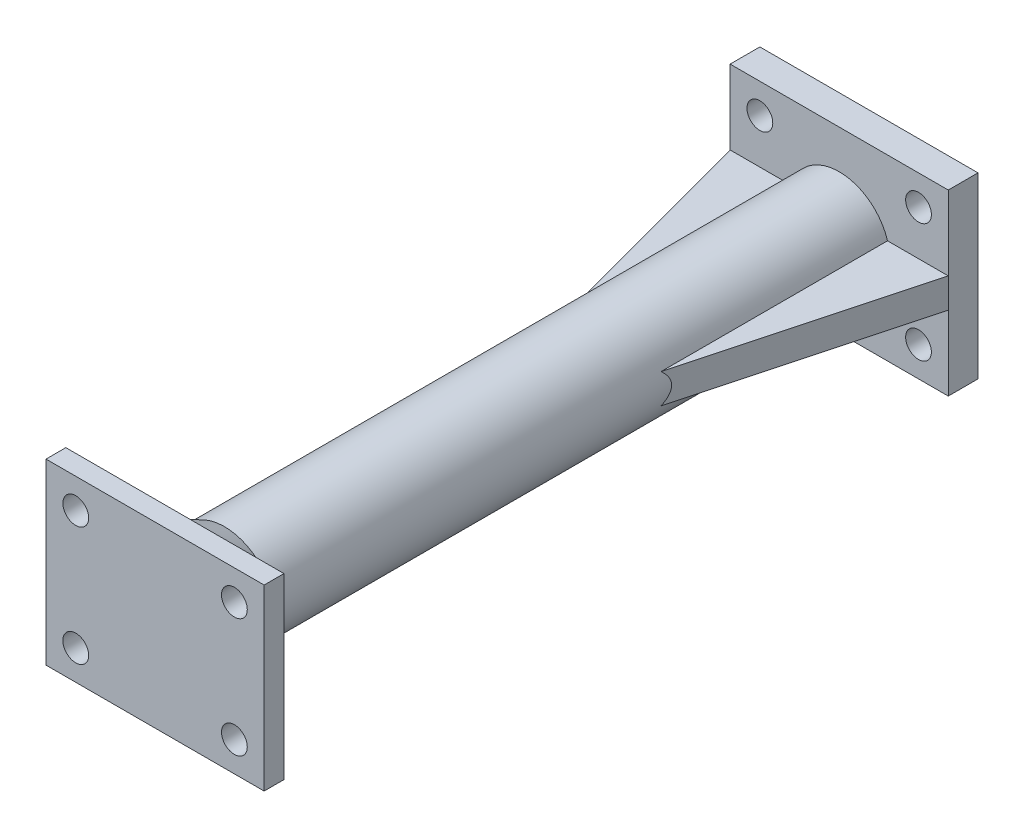
ISO-10303-21;
HEADER;
FILE_DESCRIPTION(('STEP AP214'),'2;1');
FILE_NAME('part.step','',(''),(''),'','','');
FILE_SCHEMA(('AUTOMOTIVE_DESIGN { 1 0 10303 214 1 1 1 1 }'));
ENDSEC;
DATA;
#1=APPLICATION_CONTEXT('core data for automotive mechanical design processes');
#2=APPLICATION_PROTOCOL_DEFINITION('international standard','automotive_design',2000,#1);
#3=PRODUCT_CONTEXT('',#1,'mechanical');
#4=PRODUCT('Part','Part','',(#3));
#5=PRODUCT_RELATED_PRODUCT_CATEGORY('part','',(#4));
#6=PRODUCT_DEFINITION_FORMATION('','',#4);
#7=PRODUCT_DEFINITION_CONTEXT('part definition',#1,'design');
#8=PRODUCT_DEFINITION('design','',#6,#7);
#9=PRODUCT_DEFINITION_SHAPE('','',#8);
#10=(LENGTH_UNIT() NAMED_UNIT(*) SI_UNIT(.MILLI.,.METRE.));
#11=(NAMED_UNIT(*) PLANE_ANGLE_UNIT() SI_UNIT($,.RADIAN.));
#12=(NAMED_UNIT(*) SI_UNIT($,.STERADIAN.) SOLID_ANGLE_UNIT());
#13=UNCERTAINTY_MEASURE_WITH_UNIT(LENGTH_MEASURE(1.E-05),#10,'distance_accuracy_value','');
#14=(GEOMETRIC_REPRESENTATION_CONTEXT(3) GLOBAL_UNCERTAINTY_ASSIGNED_CONTEXT((#13)) GLOBAL_UNIT_ASSIGNED_CONTEXT((#10,
#11,#12)) REPRESENTATION_CONTEXT('',''));
#15=CARTESIAN_POINT('',(0.,0.,0.));
#16=DIRECTION('',(0.,0.,1.));
#17=DIRECTION('',(1.,0.,0.));
#18=AXIS2_PLACEMENT_3D('',#15,#16,#17);
#19=CARTESIAN_POINT('',(0.,0.,3.));
#20=DIRECTION('',(0.,0.,1.));
#21=DIRECTION('',(1.,0.,0.));
#22=AXIS2_PLACEMENT_3D('',#19,#20,#21);
#23=PLANE('',#22);
#24=CARTESIAN_POINT('',(8.,-6.,3.));
#25=DIRECTION('',(0.,0.,1.));
#26=DIRECTION('',(1.,0.,0.));
#27=AXIS2_PLACEMENT_3D('',#24,#25,#26);
#28=CIRCLE('',#27,1.3);
#29=CARTESIAN_POINT('',(9.3,-6.,3.));
#30=VERTEX_POINT('',#29);
#31=EDGE_CURVE('E257',#30,#30,#28,.T.);
#32=ORIENTED_EDGE('',*,*,#31,.F.);
#33=EDGE_LOOP('',(#32));
#34=FACE_BOUND('',#33,.T.);
#35=CARTESIAN_POINT('',(-8.,-6.,3.));
#36=DIRECTION('',(0.,0.,1.));
#37=DIRECTION('',(1.,0.,0.));
#38=AXIS2_PLACEMENT_3D('',#35,#36,#37);
#39=CIRCLE('',#38,1.3);
#40=CARTESIAN_POINT('',(-6.7,-6.,3.));
#41=VERTEX_POINT('',#40);
#42=EDGE_CURVE('E260',#41,#41,#39,.T.);
#43=ORIENTED_EDGE('',*,*,#42,.F.);
#44=EDGE_LOOP('',(#43));
#45=FACE_BOUND('',#44,.T.);
#46=DIRECTION('',(0.,-1.,0.));
#47=VECTOR('',#46,1.);
#48=CARTESIAN_POINT('',(11.,0.,3.));
#49=LINE('',#48,#47);
#50=CARTESIAN_POINT('',(11.,-1.5,3.));
#51=VERTEX_POINT('',#50);
#52=CARTESIAN_POINT('',(11.,-9.,3.));
#53=VERTEX_POINT('',#52);
#54=EDGE_CURVE('E62',#51,#53,#49,.T.);
#55=ORIENTED_EDGE('',*,*,#54,.F.);
#56=DIRECTION('',(-1.,0.,0.));
#57=VECTOR('',#56,1.);
#58=CARTESIAN_POINT('',(0.,-1.5,3.));
#59=LINE('',#58,#57);
#60=CARTESIAN_POINT('',(4.87442304278157,-1.5,3.));
#61=VERTEX_POINT('',#60);
#62=EDGE_CURVE('E162',#51,#61,#59,.T.);
#63=ORIENTED_EDGE('',*,*,#62,.T.);
#64=CARTESIAN_POINT('',(0.,0.,3.));
#65=DIRECTION('',(0.,0.,1.));
#66=DIRECTION('',(1.,0.,0.));
#67=AXIS2_PLACEMENT_3D('',#64,#65,#66);
#68=CIRCLE('',#67,5.1);
#69=CARTESIAN_POINT('',(-4.87442304278158,-1.5,3.));
#70=VERTEX_POINT('',#69);
#71=EDGE_CURVE('E150',#70,#61,#68,.T.);
#72=ORIENTED_EDGE('',*,*,#71,.F.);
#73=DIRECTION('',(-1.,0.,0.));
#74=VECTOR('',#73,1.);
#75=CARTESIAN_POINT('',(0.,-1.5,3.));
#76=LINE('',#75,#74);
#77=CARTESIAN_POINT('',(-11.,-1.5,3.));
#78=VERTEX_POINT('',#77);
#79=EDGE_CURVE('E190',#70,#78,#76,.T.);
#80=ORIENTED_EDGE('',*,*,#79,.T.);
#81=DIRECTION('',(0.,-1.,0.));
#82=VECTOR('',#81,1.);
#83=CARTESIAN_POINT('',(-11.,0.,3.));
#84=LINE('',#83,#82);
#85=CARTESIAN_POINT('',(-11.,-9.,3.));
#86=VERTEX_POINT('',#85);
#87=EDGE_CURVE('E275',#78,#86,#84,.T.);
#88=ORIENTED_EDGE('',*,*,#87,.T.);
#89=DIRECTION('',(1.,0.,0.));
#90=VECTOR('',#89,1.);
#91=CARTESIAN_POINT('',(0.,-9.,3.));
#92=LINE('',#91,#90);
#93=EDGE_CURVE('E279',#86,#53,#92,.T.);
#94=ORIENTED_EDGE('',*,*,#93,.T.);
#95=EDGE_LOOP('',(#55,#63,#72,#80,#88,#94));
#96=FACE_BOUND('',#95,.T.);
#97=ADVANCED_FACE('F46',(#34,#45,#96),#23,.T.);
#98=CARTESIAN_POINT('',(11.,0.,3.));
#99=DIRECTION('',(1.,0.,0.));
#100=DIRECTION('',(0.,0.,-1.));
#101=AXIS2_PLACEMENT_3D('',#98,#99,#100);
#102=PLANE('',#101);
#103=CARTESIAN_POINT('',(11.,9.,3.));
#104=VERTEX_POINT('',#103);
#105=CARTESIAN_POINT('',(11.,1.5,3.));
#106=VERTEX_POINT('',#105);
#107=EDGE_CURVE('E270',#104,#106,#49,.T.);
#108=ORIENTED_EDGE('',*,*,#107,.T.);
#109=DIRECTION('',(0.,-1.,0.));
#110=VECTOR('',#109,1.);
#111=CARTESIAN_POINT('',(11.,0.,3.));
#112=LINE('',#111,#110);
#113=EDGE_CURVE('E180',#51,#106,#112,.F.);
#114=ORIENTED_EDGE('',*,*,#113,.F.);
#115=ORIENTED_EDGE('',*,*,#54,.T.);
#116=DIRECTION('',(0.,0.,-1.));
#117=VECTOR('',#116,1.);
#118=CARTESIAN_POINT('',(11.,-9.,3.));
#119=LINE('',#118,#117);
#120=CARTESIAN_POINT('',(11.,-9.,0.));
#121=VERTEX_POINT('',#120);
#122=EDGE_CURVE('E281',#53,#121,#119,.T.);
#123=ORIENTED_EDGE('',*,*,#122,.T.);
#124=DIRECTION('',(0.,-1.,0.));
#125=VECTOR('',#124,1.);
#126=CARTESIAN_POINT('',(11.,0.,0.));
#127=LINE('',#126,#125);
#128=CARTESIAN_POINT('',(11.,9.,0.));
#129=VERTEX_POINT('',#128);
#130=EDGE_CURVE('E293',#129,#121,#127,.T.);
#131=ORIENTED_EDGE('',*,*,#130,.F.);
#132=DIRECTION('',(0.,0.,-1.));
#133=VECTOR('',#132,1.);
#134=CARTESIAN_POINT('',(11.,9.,3.));
#135=LINE('',#134,#133);
#136=EDGE_CURVE('E309',#104,#129,#135,.T.);
#137=ORIENTED_EDGE('',*,*,#136,.F.);
#138=EDGE_LOOP('',(#108,#114,#115,#123,#131,#137));
#139=FACE_BOUND('',#138,.T.);
#140=ADVANCED_FACE('F337',(#139),#102,.T.);
#141=CARTESIAN_POINT('',(0.,9.,3.));
#142=DIRECTION('',(0.,1.,0.));
#143=DIRECTION('',(0.,0.,1.));
#144=AXIS2_PLACEMENT_3D('',#141,#142,#143);
#145=PLANE('',#144);
#146=DIRECTION('',(1.,0.,0.));
#147=VECTOR('',#146,1.);
#148=CARTESIAN_POINT('',(0.,9.,0.));
#149=LINE('',#148,#147);
#150=CARTESIAN_POINT('',(-11.,9.,0.));
#151=VERTEX_POINT('',#150);
#152=EDGE_CURVE('E295',#151,#129,#149,.T.);
#153=ORIENTED_EDGE('',*,*,#152,.F.);
#154=DIRECTION('',(0.,0.,-1.));
#155=VECTOR('',#154,1.);
#156=CARTESIAN_POINT('',(-11.,9.,3.));
#157=LINE('',#156,#155);
#158=CARTESIAN_POINT('',(-11.,9.,3.));
#159=VERTEX_POINT('',#158);
#160=EDGE_CURVE('E307',#159,#151,#157,.T.);
#161=ORIENTED_EDGE('',*,*,#160,.F.);
#162=DIRECTION('',(1.,0.,0.));
#163=VECTOR('',#162,1.);
#164=CARTESIAN_POINT('',(0.,9.,3.));
#165=LINE('',#164,#163);
#166=EDGE_CURVE('E272',#159,#104,#165,.T.);
#167=ORIENTED_EDGE('',*,*,#166,.T.);
#168=ORIENTED_EDGE('',*,*,#136,.T.);
#169=EDGE_LOOP('',(#153,#161,#167,#168));
#170=FACE_BOUND('',#169,.T.);
#171=ADVANCED_FACE('F342',(#170),#145,.T.);
#172=CARTESIAN_POINT('',(-11.,0.,3.));
#173=DIRECTION('',(1.,0.,0.));
#174=DIRECTION('',(0.,0.,-1.));
#175=AXIS2_PLACEMENT_3D('',#172,#173,#174);
#176=PLANE('',#175);
#177=DIRECTION('',(0.,-1.,0.));
#178=VECTOR('',#177,1.);
#179=CARTESIAN_POINT('',(-11.,0.,0.));
#180=LINE('',#179,#178);
#181=CARTESIAN_POINT('',(-11.,-9.,0.));
#182=VERTEX_POINT('',#181);
#183=EDGE_CURVE('E298',#151,#182,#180,.T.);
#184=ORIENTED_EDGE('',*,*,#183,.T.);
#185=DIRECTION('',(0.,0.,-1.));
#186=VECTOR('',#185,1.);
#187=CARTESIAN_POINT('',(-11.,-9.,3.));
#188=LINE('',#187,#186);
#189=EDGE_CURVE('E304',#86,#182,#188,.T.);
#190=ORIENTED_EDGE('',*,*,#189,.F.);
#191=ORIENTED_EDGE('',*,*,#87,.F.);
#192=DIRECTION('',(0.,-1.,0.));
#193=VECTOR('',#192,1.);
#194=CARTESIAN_POINT('',(-11.,0.,3.));
#195=LINE('',#194,#193);
#196=CARTESIAN_POINT('',(-11.,1.5,3.));
#197=VERTEX_POINT('',#196);
#198=EDGE_CURVE('E199',#197,#78,#195,.T.);
#199=ORIENTED_EDGE('',*,*,#198,.F.);
#200=EDGE_CURVE('E276',#159,#197,#84,.T.);
#201=ORIENTED_EDGE('',*,*,#200,.F.);
#202=ORIENTED_EDGE('',*,*,#160,.T.);
#203=EDGE_LOOP('',(#184,#190,#191,#199,#201,#202));
#204=FACE_BOUND('',#203,.T.);
#205=ADVANCED_FACE('F364',(#204),#176,.F.);
#206=CARTESIAN_POINT('',(-8.,6.,3.));
#207=DIRECTION('',(0.,0.,-1.));
#208=DIRECTION('',(-1.,0.,0.));
#209=AXIS2_PLACEMENT_3D('',#206,#207,#208);
#210=CYLINDRICAL_SURFACE('',#209,1.3);
#211=CARTESIAN_POINT('',(-8.,6.,3.));
#212=DIRECTION('',(0.,0.,1.));
#213=DIRECTION('',(1.,0.,0.));
#214=AXIS2_PLACEMENT_3D('',#211,#212,#213);
#215=CIRCLE('',#214,1.3);
#216=CARTESIAN_POINT('',(-6.7,6.,3.));
#217=VERTEX_POINT('',#216);
#218=EDGE_CURVE('E267',#217,#217,#215,.T.);
#219=ORIENTED_EDGE('',*,*,#218,.T.);
#220=EDGE_LOOP('',(#219));
#221=FACE_BOUND('',#220,.T.);
#222=CARTESIAN_POINT('',(-8.,6.,0.));
#223=DIRECTION('',(0.,0.,1.));
#224=DIRECTION('',(1.,0.,0.));
#225=AXIS2_PLACEMENT_3D('',#222,#223,#224);
#226=CIRCLE('',#225,1.3);
#227=CARTESIAN_POINT('',(-6.7,6.,0.));
#228=VERTEX_POINT('',#227);
#229=EDGE_CURVE('E290',#228,#228,#226,.T.);
#230=ORIENTED_EDGE('',*,*,#229,.F.);
#231=EDGE_LOOP('',(#230));
#232=FACE_BOUND('',#231,.T.);
#233=ADVANCED_FACE('F360',(#221,#232),#210,.F.);
#234=CARTESIAN_POINT('',(8.,6.,3.));
#235=DIRECTION('',(0.,0.,-1.));
#236=DIRECTION('',(-1.,0.,0.));
#237=AXIS2_PLACEMENT_3D('',#234,#235,#236);
#238=CYLINDRICAL_SURFACE('',#237,1.3);
#239=CARTESIAN_POINT('',(8.,6.,3.));
#240=DIRECTION('',(0.,0.,1.));
#241=DIRECTION('',(1.,0.,0.));
#242=AXIS2_PLACEMENT_3D('',#239,#240,#241);
#243=CIRCLE('',#242,1.3);
#244=CARTESIAN_POINT('',(9.3,6.,3.));
#245=VERTEX_POINT('',#244);
#246=EDGE_CURVE('E264',#245,#245,#243,.T.);
#247=ORIENTED_EDGE('',*,*,#246,.T.);
#248=EDGE_LOOP('',(#247));
#249=FACE_BOUND('',#248,.T.);
#250=CARTESIAN_POINT('',(8.,6.,0.));
#251=DIRECTION('',(0.,0.,1.));
#252=DIRECTION('',(1.,0.,0.));
#253=AXIS2_PLACEMENT_3D('',#250,#251,#252);
#254=CIRCLE('',#253,1.3);
#255=CARTESIAN_POINT('',(9.3,6.,0.));
#256=VERTEX_POINT('',#255);
#257=EDGE_CURVE('E287',#256,#256,#254,.T.);
#258=ORIENTED_EDGE('',*,*,#257,.F.);
#259=EDGE_LOOP('',(#258));
#260=FACE_BOUND('',#259,.T.);
#261=ADVANCED_FACE('F363',(#249,#260),#238,.F.);
#262=CARTESIAN_POINT('',(-8.,-6.,3.));
#263=DIRECTION('',(0.,0.,-1.));
#264=DIRECTION('',(-1.,0.,0.));
#265=AXIS2_PLACEMENT_3D('',#262,#263,#264);
#266=CYLINDRICAL_SURFACE('',#265,1.3);
#267=ORIENTED_EDGE('',*,*,#42,.T.);
#268=EDGE_LOOP('',(#267));
#269=FACE_BOUND('',#268,.T.);
#270=CARTESIAN_POINT('',(-8.,-6.,0.));
#271=DIRECTION('',(0.,0.,1.));
#272=DIRECTION('',(1.,0.,0.));
#273=AXIS2_PLACEMENT_3D('',#270,#271,#272);
#274=CIRCLE('',#273,1.3);
#275=CARTESIAN_POINT('',(-6.7,-6.,0.));
#276=VERTEX_POINT('',#275);
#277=EDGE_CURVE('E284',#276,#276,#274,.T.);
#278=ORIENTED_EDGE('',*,*,#277,.F.);
#279=EDGE_LOOP('',(#278));
#280=FACE_BOUND('',#279,.T.);
#281=ADVANCED_FACE('F376',(#269,#280),#266,.F.);
#282=CARTESIAN_POINT('',(8.,-6.,3.));
#283=DIRECTION('',(0.,0.,-1.));
#284=DIRECTION('',(-1.,0.,0.));
#285=AXIS2_PLACEMENT_3D('',#282,#283,#284);
#286=CYLINDRICAL_SURFACE('',#285,1.3);
#287=ORIENTED_EDGE('',*,*,#31,.T.);
#288=EDGE_LOOP('',(#287));
#289=FACE_BOUND('',#288,.T.);
#290=CARTESIAN_POINT('',(8.,-6.,0.));
#291=DIRECTION('',(0.,0.,1.));
#292=DIRECTION('',(1.,0.,0.));
#293=AXIS2_PLACEMENT_3D('',#290,#291,#292);
#294=CIRCLE('',#293,1.3);
#295=CARTESIAN_POINT('',(9.3,-6.,0.));
#296=VERTEX_POINT('',#295);
#297=EDGE_CURVE('E256',#296,#296,#294,.T.);
#298=ORIENTED_EDGE('',*,*,#297,.F.);
#299=EDGE_LOOP('',(#298));
#300=FACE_BOUND('',#299,.T.);
#301=ADVANCED_FACE('F352',(#289,#300),#286,.F.);
#302=CARTESIAN_POINT('',(0.,-9.,3.));
#303=DIRECTION('',(0.,1.,0.));
#304=DIRECTION('',(0.,0.,1.));
#305=AXIS2_PLACEMENT_3D('',#302,#303,#304);
#306=PLANE('',#305);
#307=DIRECTION('',(1.,0.,0.));
#308=VECTOR('',#307,1.);
#309=CARTESIAN_POINT('',(0.,-9.,0.));
#310=LINE('',#309,#308);
#311=EDGE_CURVE('E261',#182,#121,#310,.T.);
#312=ORIENTED_EDGE('',*,*,#311,.T.);
#313=ORIENTED_EDGE('',*,*,#122,.F.);
#314=ORIENTED_EDGE('',*,*,#93,.F.);
#315=ORIENTED_EDGE('',*,*,#189,.T.);
#316=EDGE_LOOP('',(#312,#313,#314,#315));
#317=FACE_BOUND('',#316,.T.);
#318=ADVANCED_FACE('F348',(#317),#306,.F.);
#319=DIRECTION('',(-1.,0.,0.));
#320=VECTOR('',#319,1.);
#321=CARTESIAN_POINT('',(0.,1.5,3.));
#322=LINE('',#321,#320);
#323=CARTESIAN_POINT('',(4.87442304278158,1.5,3.));
#324=VERTEX_POINT('',#323);
#325=EDGE_CURVE('E70',#106,#324,#322,.T.);
#326=ORIENTED_EDGE('',*,*,#325,.F.);
#327=ORIENTED_EDGE('',*,*,#107,.F.);
#328=ORIENTED_EDGE('',*,*,#166,.F.);
#329=ORIENTED_EDGE('',*,*,#200,.T.);
#330=DIRECTION('',(-1.,0.,0.));
#331=VECTOR('',#330,1.);
#332=CARTESIAN_POINT('',(0.,1.5,3.));
#333=LINE('',#332,#331);
#334=CARTESIAN_POINT('',(-4.87442304278158,1.5,3.));
#335=VERTEX_POINT('',#334);
#336=EDGE_CURVE('E194',#335,#197,#333,.T.);
#337=ORIENTED_EDGE('',*,*,#336,.F.);
#338=EDGE_CURVE('E159',#324,#335,#68,.T.);
#339=ORIENTED_EDGE('',*,*,#338,.F.);
#340=EDGE_LOOP('',(#326,#327,#328,#329,#337,#339));
#341=FACE_BOUND('',#340,.T.);
#342=ORIENTED_EDGE('',*,*,#246,.F.);
#343=EDGE_LOOP('',(#342));
#344=FACE_BOUND('',#343,.T.);
#345=ORIENTED_EDGE('',*,*,#218,.F.);
#346=EDGE_LOOP('',(#345));
#347=FACE_BOUND('',#346,.T.);
#348=ADVANCED_FACE('F331',(#341,#344,#347),#23,.T.);
#349=CARTESIAN_POINT('',(0.,0.,0.));
#350=DIRECTION('',(0.,0.,1.));
#351=DIRECTION('',(1.,0.,0.));
#352=AXIS2_PLACEMENT_3D('',#349,#350,#351);
#353=PLANE('',#352);
#354=ORIENTED_EDGE('',*,*,#257,.T.);
#355=EDGE_LOOP('',(#354));
#356=FACE_BOUND('',#355,.T.);
#357=ORIENTED_EDGE('',*,*,#229,.T.);
#358=EDGE_LOOP('',(#357));
#359=FACE_BOUND('',#358,.T.);
#360=ORIENTED_EDGE('',*,*,#130,.T.);
#361=ORIENTED_EDGE('',*,*,#311,.F.);
#362=ORIENTED_EDGE('',*,*,#183,.F.);
#363=ORIENTED_EDGE('',*,*,#152,.T.);
#364=EDGE_LOOP('',(#360,#361,#362,#363));
#365=FACE_BOUND('',#364,.T.);
#366=ORIENTED_EDGE('',*,*,#297,.T.);
#367=EDGE_LOOP('',(#366));
#368=FACE_BOUND('',#367,.T.);
#369=ORIENTED_EDGE('',*,*,#277,.T.);
#370=EDGE_LOOP('',(#369));
#371=FACE_BOUND('',#370,.T.);
#372=ADVANCED_FACE('F322',(#356,#359,#365,#368,#371),#353,.F.);
#373=CARTESIAN_POINT('',(0.,0.,70.));
#374=DIRECTION('',(0.,0.,-1.));
#375=DIRECTION('',(-1.,0.,0.));
#376=AXIS2_PLACEMENT_3D('',#373,#374,#375);
#377=CYLINDRICAL_SURFACE('',#376,5.1);
#378=DIRECTION('',(0.,0.,-1.));
#379=VECTOR('',#378,1.);
#380=CARTESIAN_POINT('',(4.87442304278157,1.5,70.));
#381=LINE('',#380,#379);
#382=CARTESIAN_POINT('',(4.87442304278158,1.5,25.8411344167467));
#383=VERTEX_POINT('',#382);
#384=EDGE_CURVE('E166',#383,#324,#381,.T.);
#385=ORIENTED_EDGE('',*,*,#384,.T.);
#386=ORIENTED_EDGE('',*,*,#338,.T.);
#387=DIRECTION('',(0.,0.,-1.));
#388=VECTOR('',#387,1.);
#389=CARTESIAN_POINT('',(-4.87442304278157,1.5,70.));
#390=LINE('',#389,#388);
#391=CARTESIAN_POINT('',(-4.87442304278158,1.5,25.8411344167467));
#392=VERTEX_POINT('',#391);
#393=EDGE_CURVE('E192',#335,#392,#390,.F.);
#394=ORIENTED_EDGE('',*,*,#393,.T.);
#395=CARTESIAN_POINT('',(0.,0.,44.0169491525424));
#396=DIRECTION('',(-0.965869632003452,0.,0.259028674037289));
#397=DIRECTION('',(-0.259028674037289,0.,-0.965869632003452));
#398=AXIS2_PLACEMENT_3D('',#395,#396,#397);
#399=ELLIPSE('',#398,19.6889399173846,5.1);
#400=CARTESIAN_POINT('',(-4.87442304278158,-1.5,25.8411344167466));
#401=VERTEX_POINT('',#400);
#402=EDGE_CURVE('E197',#392,#401,#399,.T.);
#403=ORIENTED_EDGE('',*,*,#402,.T.);
#404=DIRECTION('',(0.,0.,-1.));
#405=VECTOR('',#404,1.);
#406=CARTESIAN_POINT('',(-4.87442304278157,-1.5,70.));
#407=LINE('',#406,#405);
#408=EDGE_CURVE('E157',#70,#401,#407,.F.);
#409=ORIENTED_EDGE('',*,*,#408,.F.);
#410=ORIENTED_EDGE('',*,*,#71,.T.);
#411=DIRECTION('',(0.,0.,-1.));
#412=VECTOR('',#411,1.);
#413=CARTESIAN_POINT('',(4.87442304278157,-1.5,70.));
#414=LINE('',#413,#412);
#415=CARTESIAN_POINT('',(4.87442304278158,-1.5,25.8411344167466));
#416=VERTEX_POINT('',#415);
#417=EDGE_CURVE('E154',#416,#61,#414,.T.);
#418=ORIENTED_EDGE('',*,*,#417,.F.);
#419=CARTESIAN_POINT('',(0.,0.,44.0169491525424));
#420=DIRECTION('',(-0.965869632003452,0.,-0.259028674037289));
#421=DIRECTION('',(0.259028674037289,0.,-0.965869632003452));
#422=AXIS2_PLACEMENT_3D('',#419,#420,#421);
#423=ELLIPSE('',#422,19.6889399173846,5.1);
#424=EDGE_CURVE('E178',#416,#383,#423,.F.);
#425=ORIENTED_EDGE('',*,*,#424,.T.);
#426=EDGE_LOOP('',(#385,#386,#394,#403,#409,#410,#418,#425));
#427=FACE_BOUND('',#426,.T.);
#428=CARTESIAN_POINT('',(0.,0.,65.));
#429=DIRECTION('',(0.,0.,1.));
#430=DIRECTION('',(1.,0.,0.));
#431=AXIS2_PLACEMENT_3D('',#428,#429,#430);
#432=CIRCLE('',#431,5.1);
#433=CARTESIAN_POINT('',(5.1,0.,65.));
#434=VERTEX_POINT('',#433);
#435=EDGE_CURVE('E11',#434,#434,#432,.F.);
#436=ORIENTED_EDGE('',*,*,#435,.T.);
#437=EDGE_LOOP('',(#436));
#438=FACE_BOUND('',#437,.T.);
#439=ADVANCED_FACE('F151',(#427,#438),#377,.T.);
#440=CARTESIAN_POINT('',(11.,0.,72.));
#441=DIRECTION('',(1.,0.,0.));
#442=DIRECTION('',(0.,0.,-1.));
#443=AXIS2_PLACEMENT_3D('',#440,#441,#442);
#444=PLANE('',#443);
#445=DIRECTION('',(0.,-1.,0.));
#446=VECTOR('',#445,1.);
#447=CARTESIAN_POINT('',(11.,0.,72.));
#448=LINE('',#447,#446);
#449=CARTESIAN_POINT('',(11.,9.,72.));
#450=VERTEX_POINT('',#449);
#451=CARTESIAN_POINT('',(11.,-9.,72.));
#452=VERTEX_POINT('',#451);
#453=EDGE_CURVE('E216',#450,#452,#448,.T.);
#454=ORIENTED_EDGE('',*,*,#453,.T.);
#455=DIRECTION('',(0.,0.,-1.));
#456=VECTOR('',#455,1.);
#457=CARTESIAN_POINT('',(11.,-9.,72.));
#458=LINE('',#457,#456);
#459=CARTESIAN_POINT('',(11.,-9.,70.));
#460=VERTEX_POINT('',#459);
#461=EDGE_CURVE('E226',#452,#460,#458,.T.);
#462=ORIENTED_EDGE('',*,*,#461,.T.);
#463=DIRECTION('',(0.,-1.,0.));
#464=VECTOR('',#463,1.);
#465=CARTESIAN_POINT('',(11.,0.,70.));
#466=LINE('',#465,#464);
#467=CARTESIAN_POINT('',(11.,9.,70.));
#468=VERTEX_POINT('',#467);
#469=EDGE_CURVE('E238',#468,#460,#466,.T.);
#470=ORIENTED_EDGE('',*,*,#469,.F.);
#471=DIRECTION('',(0.,0.,-1.));
#472=VECTOR('',#471,1.);
#473=CARTESIAN_POINT('',(11.,9.,72.));
#474=LINE('',#473,#472);
#475=EDGE_CURVE('E254',#450,#468,#474,.T.);
#476=ORIENTED_EDGE('',*,*,#475,.F.);
#477=EDGE_LOOP('',(#454,#462,#470,#476));
#478=FACE_BOUND('',#477,.T.);
#479=ADVANCED_FACE('F321',(#478),#444,.T.);
#480=CARTESIAN_POINT('',(0.,9.,72.));
#481=DIRECTION('',(0.,1.,0.));
#482=DIRECTION('',(0.,0.,1.));
#483=AXIS2_PLACEMENT_3D('',#480,#481,#482);
#484=PLANE('',#483);
#485=DIRECTION('',(1.,0.,0.));
#486=VECTOR('',#485,1.);
#487=CARTESIAN_POINT('',(0.,9.,70.));
#488=LINE('',#487,#486);
#489=CARTESIAN_POINT('',(-11.,9.,70.));
#490=VERTEX_POINT('',#489);
#491=EDGE_CURVE('E240',#490,#468,#488,.T.);
#492=ORIENTED_EDGE('',*,*,#491,.F.);
#493=DIRECTION('',(0.,0.,-1.));
#494=VECTOR('',#493,1.);
#495=CARTESIAN_POINT('',(-11.,9.,72.));
#496=LINE('',#495,#494);
#497=CARTESIAN_POINT('',(-11.,9.,72.));
#498=VERTEX_POINT('',#497);
#499=EDGE_CURVE('E252',#498,#490,#496,.T.);
#500=ORIENTED_EDGE('',*,*,#499,.F.);
#501=DIRECTION('',(1.,0.,0.));
#502=VECTOR('',#501,1.);
#503=CARTESIAN_POINT('',(0.,9.,72.));
#504=LINE('',#503,#502);
#505=EDGE_CURVE('E218',#498,#450,#504,.T.);
#506=ORIENTED_EDGE('',*,*,#505,.T.);
#507=ORIENTED_EDGE('',*,*,#475,.T.);
#508=EDGE_LOOP('',(#492,#500,#506,#507));
#509=FACE_BOUND('',#508,.T.);
#510=ADVANCED_FACE('F328',(#509),#484,.T.);
#511=CARTESIAN_POINT('',(-11.,0.,72.));
#512=DIRECTION('',(1.,0.,0.));
#513=DIRECTION('',(0.,0.,-1.));
#514=AXIS2_PLACEMENT_3D('',#511,#512,#513);
#515=PLANE('',#514);
#516=DIRECTION('',(0.,-1.,0.));
#517=VECTOR('',#516,1.);
#518=CARTESIAN_POINT('',(-11.,0.,70.));
#519=LINE('',#518,#517);
#520=CARTESIAN_POINT('',(-11.,-9.,70.));
#521=VERTEX_POINT('',#520);
#522=EDGE_CURVE('E243',#490,#521,#519,.T.);
#523=ORIENTED_EDGE('',*,*,#522,.T.);
#524=DIRECTION('',(0.,0.,-1.));
#525=VECTOR('',#524,1.);
#526=CARTESIAN_POINT('',(-11.,-9.,72.));
#527=LINE('',#526,#525);
#528=CARTESIAN_POINT('',(-11.,-9.,72.));
#529=VERTEX_POINT('',#528);
#530=EDGE_CURVE('E249',#529,#521,#527,.T.);
#531=ORIENTED_EDGE('',*,*,#530,.F.);
#532=DIRECTION('',(0.,-1.,0.));
#533=VECTOR('',#532,1.);
#534=CARTESIAN_POINT('',(-11.,0.,72.));
#535=LINE('',#534,#533);
#536=EDGE_CURVE('E221',#498,#529,#535,.T.);
#537=ORIENTED_EDGE('',*,*,#536,.F.);
#538=ORIENTED_EDGE('',*,*,#499,.T.);
#539=EDGE_LOOP('',(#523,#531,#537,#538));
#540=FACE_BOUND('',#539,.T.);
#541=ADVANCED_FACE('F436',(#540),#515,.F.);
#542=CARTESIAN_POINT('',(-8.,6.,72.));
#543=DIRECTION('',(0.,0.,-1.));
#544=DIRECTION('',(-1.,0.,0.));
#545=AXIS2_PLACEMENT_3D('',#542,#543,#544);
#546=CYLINDRICAL_SURFACE('',#545,1.3);
#547=CARTESIAN_POINT('',(-8.,6.,72.));
#548=DIRECTION('',(0.,0.,1.));
#549=DIRECTION('',(1.,0.,0.));
#550=AXIS2_PLACEMENT_3D('',#547,#548,#549);
#551=CIRCLE('',#550,1.3);
#552=CARTESIAN_POINT('',(-6.7,6.,72.));
#553=VERTEX_POINT('',#552);
#554=EDGE_CURVE('E213',#553,#553,#551,.T.);
#555=ORIENTED_EDGE('',*,*,#554,.T.);
#556=EDGE_LOOP('',(#555));
#557=FACE_BOUND('',#556,.T.);
#558=CARTESIAN_POINT('',(-8.,6.,70.));
#559=DIRECTION('',(0.,0.,1.));
#560=DIRECTION('',(1.,0.,0.));
#561=AXIS2_PLACEMENT_3D('',#558,#559,#560);
#562=CIRCLE('',#561,1.3);
#563=CARTESIAN_POINT('',(-6.7,6.,70.));
#564=VERTEX_POINT('',#563);
#565=EDGE_CURVE('E235',#564,#564,#562,.T.);
#566=ORIENTED_EDGE('',*,*,#565,.F.);
#567=EDGE_LOOP('',(#566));
#568=FACE_BOUND('',#567,.T.);
#569=ADVANCED_FACE('F439',(#557,#568),#546,.F.);
#570=CARTESIAN_POINT('',(8.,-6.,72.));
#571=DIRECTION('',(0.,0.,-1.));
#572=DIRECTION('',(-1.,0.,0.));
#573=AXIS2_PLACEMENT_3D('',#570,#571,#572);
#574=CYLINDRICAL_SURFACE('',#573,1.3);
#575=CARTESIAN_POINT('',(8.,-6.,72.));
#576=DIRECTION('',(0.,0.,1.));
#577=DIRECTION('',(1.,0.,0.));
#578=AXIS2_PLACEMENT_3D('',#575,#576,#577);
#579=CIRCLE('',#578,1.3);
#580=CARTESIAN_POINT('',(9.3,-6.,72.));
#581=VERTEX_POINT('',#580);
#582=EDGE_CURVE('E210',#581,#581,#579,.T.);
#583=ORIENTED_EDGE('',*,*,#582,.T.);
#584=EDGE_LOOP('',(#583));
#585=FACE_BOUND('',#584,.T.);
#586=CARTESIAN_POINT('',(8.,-6.,70.));
#587=DIRECTION('',(0.,0.,1.));
#588=DIRECTION('',(1.,0.,0.));
#589=AXIS2_PLACEMENT_3D('',#586,#587,#588);
#590=CIRCLE('',#589,1.3);
#591=CARTESIAN_POINT('',(9.3,-6.,70.));
#592=VERTEX_POINT('',#591);
#593=EDGE_CURVE('E232',#592,#592,#590,.T.);
#594=ORIENTED_EDGE('',*,*,#593,.F.);
#595=EDGE_LOOP('',(#594));
#596=FACE_BOUND('',#595,.T.);
#597=ADVANCED_FACE('F446',(#585,#596),#574,.F.);
#598=CARTESIAN_POINT('',(8.,6.,72.));
#599=DIRECTION('',(0.,0.,-1.));
#600=DIRECTION('',(-1.,0.,0.));
#601=AXIS2_PLACEMENT_3D('',#598,#599,#600);
#602=CYLINDRICAL_SURFACE('',#601,1.3);
#603=CARTESIAN_POINT('',(8.,6.,72.));
#604=DIRECTION('',(0.,0.,1.));
#605=DIRECTION('',(1.,0.,0.));
#606=AXIS2_PLACEMENT_3D('',#603,#604,#605);
#607=CIRCLE('',#606,1.3);
#608=CARTESIAN_POINT('',(9.3,6.,72.));
#609=VERTEX_POINT('',#608);
#610=EDGE_CURVE('E206',#609,#609,#607,.T.);
#611=ORIENTED_EDGE('',*,*,#610,.T.);
#612=EDGE_LOOP('',(#611));
#613=FACE_BOUND('',#612,.T.);
#614=CARTESIAN_POINT('',(8.,6.,70.));
#615=DIRECTION('',(0.,0.,1.));
#616=DIRECTION('',(1.,0.,0.));
#617=AXIS2_PLACEMENT_3D('',#614,#615,#616);
#618=CIRCLE('',#617,1.3);
#619=CARTESIAN_POINT('',(9.3,6.,70.));
#620=VERTEX_POINT('',#619);
#621=EDGE_CURVE('E229',#620,#620,#618,.T.);
#622=ORIENTED_EDGE('',*,*,#621,.F.);
#623=EDGE_LOOP('',(#622));
#624=FACE_BOUND('',#623,.T.);
#625=ADVANCED_FACE('F450',(#613,#624),#602,.F.);
#626=CARTESIAN_POINT('',(-8.,-6.,72.));
#627=DIRECTION('',(0.,0.,-1.));
#628=DIRECTION('',(-1.,0.,0.));
#629=AXIS2_PLACEMENT_3D('',#626,#627,#628);
#630=CYLINDRICAL_SURFACE('',#629,1.3);
#631=CARTESIAN_POINT('',(-8.,-6.,72.));
#632=DIRECTION('',(0.,0.,1.));
#633=DIRECTION('',(1.,0.,0.));
#634=AXIS2_PLACEMENT_3D('',#631,#632,#633);
#635=CIRCLE('',#634,1.3);
#636=CARTESIAN_POINT('',(-6.7,-6.,72.));
#637=VERTEX_POINT('',#636);
#638=EDGE_CURVE('E203',#637,#637,#635,.T.);
#639=ORIENTED_EDGE('',*,*,#638,.T.);
#640=EDGE_LOOP('',(#639));
#641=FACE_BOUND('',#640,.T.);
#642=CARTESIAN_POINT('',(-8.,-6.,70.));
#643=DIRECTION('',(0.,0.,1.));
#644=DIRECTION('',(1.,0.,0.));
#645=AXIS2_PLACEMENT_3D('',#642,#643,#644);
#646=CIRCLE('',#645,1.3);
#647=CARTESIAN_POINT('',(-6.7,-6.,70.));
#648=VERTEX_POINT('',#647);
#649=EDGE_CURVE('E202',#648,#648,#646,.T.);
#650=ORIENTED_EDGE('',*,*,#649,.F.);
#651=EDGE_LOOP('',(#650));
#652=FACE_BOUND('',#651,.T.);
#653=ADVANCED_FACE('F434',(#641,#652),#630,.F.);
#654=CARTESIAN_POINT('',(0.,-9.,72.));
#655=DIRECTION('',(0.,1.,0.));
#656=DIRECTION('',(0.,0.,1.));
#657=AXIS2_PLACEMENT_3D('',#654,#655,#656);
#658=PLANE('',#657);
#659=DIRECTION('',(1.,0.,0.));
#660=VECTOR('',#659,1.);
#661=CARTESIAN_POINT('',(0.,-9.,70.));
#662=LINE('',#661,#660);
#663=EDGE_CURVE('E207',#521,#460,#662,.T.);
#664=ORIENTED_EDGE('',*,*,#663,.T.);
#665=ORIENTED_EDGE('',*,*,#461,.F.);
#666=DIRECTION('',(1.,0.,0.));
#667=VECTOR('',#666,1.);
#668=CARTESIAN_POINT('',(0.,-9.,72.));
#669=LINE('',#668,#667);
#670=EDGE_CURVE('E223',#529,#452,#669,.T.);
#671=ORIENTED_EDGE('',*,*,#670,.F.);
#672=ORIENTED_EDGE('',*,*,#530,.T.);
#673=EDGE_LOOP('',(#664,#665,#671,#672));
#674=FACE_BOUND('',#673,.T.);
#675=ADVANCED_FACE('F427',(#674),#658,.F.);
#676=CARTESIAN_POINT('',(0.,0.,72.));
#677=DIRECTION('',(0.,0.,1.));
#678=DIRECTION('',(1.,0.,0.));
#679=AXIS2_PLACEMENT_3D('',#676,#677,#678);
#680=PLANE('',#679);
#681=ORIENTED_EDGE('',*,*,#536,.T.);
#682=ORIENTED_EDGE('',*,*,#670,.T.);
#683=ORIENTED_EDGE('',*,*,#453,.F.);
#684=ORIENTED_EDGE('',*,*,#505,.F.);
#685=EDGE_LOOP('',(#681,#682,#683,#684));
#686=FACE_BOUND('',#685,.T.);
#687=ORIENTED_EDGE('',*,*,#638,.F.);
#688=EDGE_LOOP('',(#687));
#689=FACE_BOUND('',#688,.T.);
#690=ORIENTED_EDGE('',*,*,#610,.F.);
#691=EDGE_LOOP('',(#690));
#692=FACE_BOUND('',#691,.T.);
#693=ORIENTED_EDGE('',*,*,#582,.F.);
#694=EDGE_LOOP('',(#693));
#695=FACE_BOUND('',#694,.T.);
#696=ORIENTED_EDGE('',*,*,#554,.F.);
#697=EDGE_LOOP('',(#696));
#698=FACE_BOUND('',#697,.T.);
#699=ADVANCED_FACE('F424',(#686,#689,#692,#695,#698),#680,.T.);
#700=CARTESIAN_POINT('',(0.,0.,70.));
#701=DIRECTION('',(0.,0.,1.));
#702=DIRECTION('',(1.,0.,0.));
#703=AXIS2_PLACEMENT_3D('',#700,#701,#702);
#704=PLANE('',#703);
#705=ORIENTED_EDGE('',*,*,#663,.F.);
#706=ORIENTED_EDGE('',*,*,#522,.F.);
#707=ORIENTED_EDGE('',*,*,#491,.T.);
#708=ORIENTED_EDGE('',*,*,#469,.T.);
#709=EDGE_LOOP('',(#705,#706,#707,#708));
#710=FACE_BOUND('',#709,.T.);
#711=CARTESIAN_POINT('',(0.,0.,70.));
#712=DIRECTION('',(0.,0.,1.));
#713=DIRECTION('',(1.,0.,0.));
#714=AXIS2_PLACEMENT_3D('',#711,#712,#713);
#715=CIRCLE('',#714,7.43153829077501);
#716=CARTESIAN_POINT('',(7.43153829077501,0.,70.));
#717=VERTEX_POINT('',#716);
#718=EDGE_CURVE('E55',#717,#717,#715,.T.);
#719=ORIENTED_EDGE('',*,*,#718,.T.);
#720=EDGE_LOOP('',(#719));
#721=FACE_BOUND('',#720,.T.);
#722=ORIENTED_EDGE('',*,*,#649,.T.);
#723=EDGE_LOOP('',(#722));
#724=FACE_BOUND('',#723,.T.);
#725=ORIENTED_EDGE('',*,*,#621,.T.);
#726=EDGE_LOOP('',(#725));
#727=FACE_BOUND('',#726,.T.);
#728=ORIENTED_EDGE('',*,*,#593,.T.);
#729=EDGE_LOOP('',(#728));
#730=FACE_BOUND('',#729,.T.);
#731=ORIENTED_EDGE('',*,*,#565,.T.);
#732=EDGE_LOOP('',(#731));
#733=FACE_BOUND('',#732,.T.);
#734=ADVANCED_FACE('F313',(#710,#721,#724,#727,#730,#733),#704,.F.);
#735=CARTESIAN_POINT('',(0.,0.,70.));
#736=DIRECTION('',(0.,0.,1.));
#737=DIRECTION('',(1.,0.,0.));
#738=AXIS2_PLACEMENT_3D('',#735,#736,#737);
#739=CONICAL_SURFACE('',#738,7.43153829077501,0.436332312998587);
#740=ORIENTED_EDGE('',*,*,#718,.F.);
#741=EDGE_LOOP('',(#740));
#742=FACE_BOUND('',#741,.T.);
#743=ORIENTED_EDGE('',*,*,#435,.F.);
#744=EDGE_LOOP('',(#743));
#745=FACE_BOUND('',#744,.T.);
#746=ADVANCED_FACE('F49',(#742,#745),#739,.T.);
#747=CARTESIAN_POINT('',(-11.,0.,3.));
#748=DIRECTION('',(-0.965869632003452,0.,0.259028674037289));
#749=DIRECTION('',(0.259028674037289,0.,0.965869632003452));
#750=AXIS2_PLACEMENT_3D('',#747,#748,#749);
#751=PLANE('',#750);
#752=DIRECTION('',(0.259028674037289,0.,0.965869632003452));
#753=VECTOR('',#752,1.);
#754=CARTESIAN_POINT('',(-11.,1.5,3.));
#755=LINE('',#754,#753);
#756=EDGE_CURVE('E184',#197,#392,#755,.T.);
#757=ORIENTED_EDGE('',*,*,#756,.F.);
#758=ORIENTED_EDGE('',*,*,#198,.T.);
#759=DIRECTION('',(0.259028674037289,0.,0.965869632003452));
#760=VECTOR('',#759,1.);
#761=CARTESIAN_POINT('',(-11.,-1.5,3.));
#762=LINE('',#761,#760);
#763=EDGE_CURVE('E183',#78,#401,#762,.T.);
#764=ORIENTED_EDGE('',*,*,#763,.T.);
#765=ORIENTED_EDGE('',*,*,#402,.F.);
#766=EDGE_LOOP('',(#757,#758,#764,#765));
#767=FACE_BOUND('',#766,.T.);
#768=ADVANCED_FACE('F318',(#767),#751,.T.);
#769=CARTESIAN_POINT('',(0.,1.5,36.));
#770=DIRECTION('',(0.,1.,0.));
#771=DIRECTION('',(0.,0.,1.));
#772=AXIS2_PLACEMENT_3D('',#769,#770,#771);
#773=PLANE('',#772);
#774=ORIENTED_EDGE('',*,*,#756,.T.);
#775=ORIENTED_EDGE('',*,*,#393,.F.);
#776=ORIENTED_EDGE('',*,*,#336,.T.);
#777=EDGE_LOOP('',(#774,#775,#776));
#778=FACE_BOUND('',#777,.T.);
#779=ADVANCED_FACE('F410',(#778),#773,.T.);
#780=CARTESIAN_POINT('',(0.,-1.5,36.));
#781=DIRECTION('',(0.,1.,0.));
#782=DIRECTION('',(0.,0.,1.));
#783=AXIS2_PLACEMENT_3D('',#780,#781,#782);
#784=PLANE('',#783);
#785=ORIENTED_EDGE('',*,*,#79,.F.);
#786=ORIENTED_EDGE('',*,*,#408,.T.);
#787=ORIENTED_EDGE('',*,*,#763,.F.);
#788=EDGE_LOOP('',(#785,#786,#787));
#789=FACE_BOUND('',#788,.T.);
#790=ADVANCED_FACE('F407',(#789),#784,.F.);
#791=CARTESIAN_POINT('',(11.,0.,3.));
#792=DIRECTION('',(-0.965869632003452,0.,-0.259028674037289));
#793=DIRECTION('',(-0.259028674037289,0.,0.965869632003452));
#794=AXIS2_PLACEMENT_3D('',#791,#792,#793);
#795=PLANE('',#794);
#796=DIRECTION('',(-0.259028674037289,0.,0.965869632003452));
#797=VECTOR('',#796,1.);
#798=CARTESIAN_POINT('',(11.,-1.5,3.));
#799=LINE('',#798,#797);
#800=EDGE_CURVE('E169',#51,#416,#799,.T.);
#801=ORIENTED_EDGE('',*,*,#800,.F.);
#802=ORIENTED_EDGE('',*,*,#113,.T.);
#803=DIRECTION('',(-0.259028674037289,0.,0.965869632003452));
#804=VECTOR('',#803,1.);
#805=CARTESIAN_POINT('',(11.,1.5,3.));
#806=LINE('',#805,#804);
#807=EDGE_CURVE('E170',#106,#383,#806,.T.);
#808=ORIENTED_EDGE('',*,*,#807,.T.);
#809=ORIENTED_EDGE('',*,*,#424,.F.);
#810=EDGE_LOOP('',(#801,#802,#808,#809));
#811=FACE_BOUND('',#810,.T.);
#812=ADVANCED_FACE('F409',(#811),#795,.F.);
#813=CARTESIAN_POINT('',(0.,1.5,36.));
#814=DIRECTION('',(0.,1.,0.));
#815=DIRECTION('',(0.,0.,1.));
#816=AXIS2_PLACEMENT_3D('',#813,#814,#815);
#817=PLANE('',#816);
#818=ORIENTED_EDGE('',*,*,#325,.T.);
#819=ORIENTED_EDGE('',*,*,#384,.F.);
#820=ORIENTED_EDGE('',*,*,#807,.F.);
#821=EDGE_LOOP('',(#818,#819,#820));
#822=FACE_BOUND('',#821,.T.);
#823=ADVANCED_FACE('F416',(#822),#817,.T.);
#824=CARTESIAN_POINT('',(0.,-1.5,36.));
#825=DIRECTION('',(0.,1.,0.));
#826=DIRECTION('',(0.,0.,1.));
#827=AXIS2_PLACEMENT_3D('',#824,#825,#826);
#828=PLANE('',#827);
#829=ORIENTED_EDGE('',*,*,#62,.F.);
#830=ORIENTED_EDGE('',*,*,#800,.T.);
#831=ORIENTED_EDGE('',*,*,#417,.T.);
#832=EDGE_LOOP('',(#829,#830,#831));
#833=FACE_BOUND('',#832,.T.);
#834=ADVANCED_FACE('F168',(#833),#828,.F.);
#835=CLOSED_SHELL('',(#97,#140,#171,#205,#233,#261,#281,#301,#318,#348,#372,#439,#479,#510,#541,
#569,#597,#625,#653,#675,#699,#734,#746,#768,#779,#790,#812,#823,#834));
#836=MANIFOLD_SOLID_BREP('B2',#835);
#837=ADVANCED_BREP_SHAPE_REPRESENTATION('',(#18,#836),#14);
#838=SHAPE_DEFINITION_REPRESENTATION(#9,#837);
ENDSEC;
END-ISO-10303-21;
